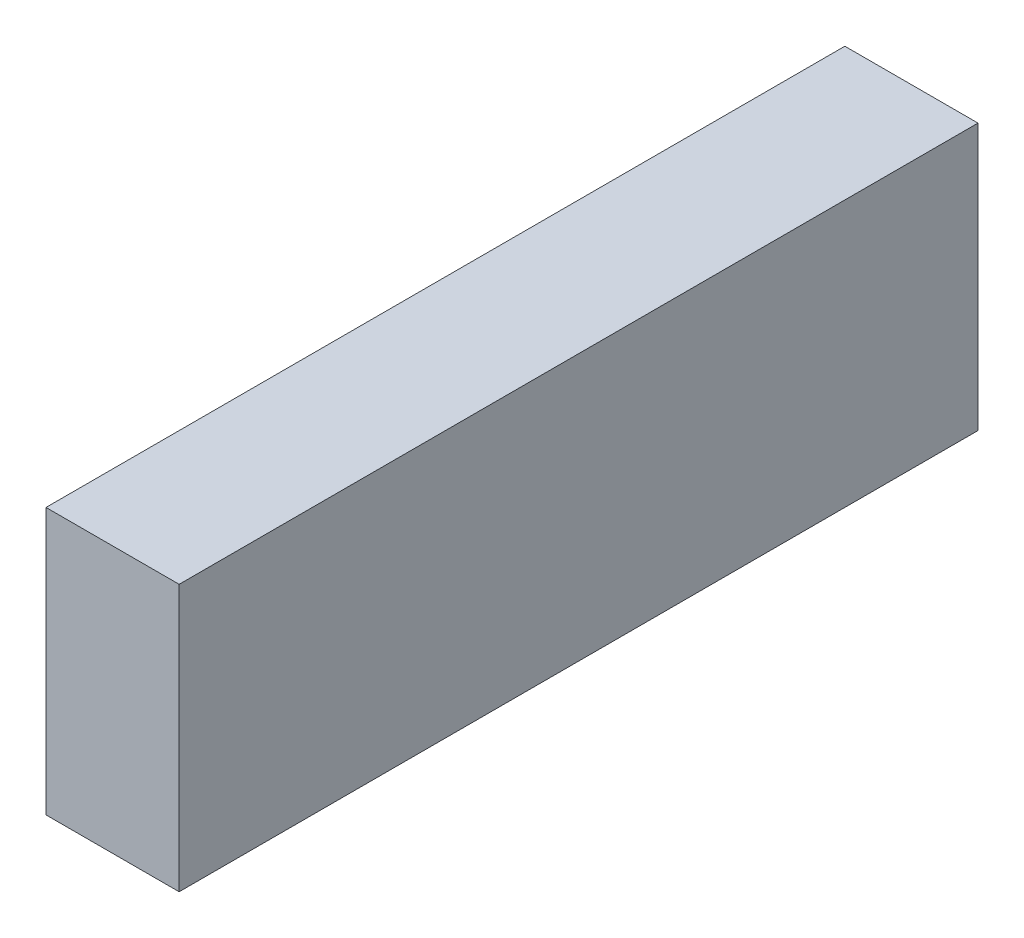
ISO-10303-21;
HEADER;
FILE_DESCRIPTION(('STEP AP214'),'2;1');
FILE_NAME('part.step','',(''),(''),'','','');
FILE_SCHEMA(('AUTOMOTIVE_DESIGN { 1 0 10303 214 1 1 1 1 }'));
ENDSEC;
DATA;
#1=APPLICATION_CONTEXT('core data for automotive mechanical design processes');
#2=APPLICATION_PROTOCOL_DEFINITION('international standard','automotive_design',2000,#1);
#3=PRODUCT_CONTEXT('',#1,'mechanical');
#4=PRODUCT('Part','Part','',(#3));
#5=PRODUCT_RELATED_PRODUCT_CATEGORY('part','',(#4));
#6=PRODUCT_DEFINITION_FORMATION('','',#4);
#7=PRODUCT_DEFINITION_CONTEXT('part definition',#1,'design');
#8=PRODUCT_DEFINITION('design','',#6,#7);
#9=PRODUCT_DEFINITION_SHAPE('','',#8);
#10=(LENGTH_UNIT() NAMED_UNIT(*) SI_UNIT(.MILLI.,.METRE.));
#11=(NAMED_UNIT(*) PLANE_ANGLE_UNIT() SI_UNIT($,.RADIAN.));
#12=(NAMED_UNIT(*) SI_UNIT($,.STERADIAN.) SOLID_ANGLE_UNIT());
#13=UNCERTAINTY_MEASURE_WITH_UNIT(LENGTH_MEASURE(1.E-05),#10,'distance_accuracy_value','');
#14=(GEOMETRIC_REPRESENTATION_CONTEXT(3) GLOBAL_UNCERTAINTY_ASSIGNED_CONTEXT((#13)) GLOBAL_UNIT_ASSIGNED_CONTEXT((#10,
#11,#12)) REPRESENTATION_CONTEXT('',''));
#15=CARTESIAN_POINT('',(0.,0.,0.));
#16=DIRECTION('',(0.,0.,1.));
#17=DIRECTION('',(1.,0.,0.));
#18=AXIS2_PLACEMENT_3D('',#15,#16,#17);
#19=CARTESIAN_POINT('',(25.,100.,150.));
#20=DIRECTION('',(-1.,0.,0.));
#21=DIRECTION('',(0.,0.,1.));
#22=AXIS2_PLACEMENT_3D('',#19,#20,#21);
#23=PLANE('',#22);
#24=DIRECTION('',(0.,0.,-1.));
#25=VECTOR('',#24,1.);
#26=CARTESIAN_POINT('',(25.,0.,150.));
#27=LINE('',#26,#25);
#28=CARTESIAN_POINT('',(25.,0.,150.));
#29=VERTEX_POINT('',#28);
#30=CARTESIAN_POINT('',(25.,0.,-150.));
#31=VERTEX_POINT('',#30);
#32=EDGE_CURVE('E96',#29,#31,#27,.T.);
#33=ORIENTED_EDGE('',*,*,#32,.T.);
#34=DIRECTION('',(0.,-1.,0.));
#35=VECTOR('',#34,1.);
#36=CARTESIAN_POINT('',(25.,100.,-150.));
#37=LINE('',#36,#35);
#38=CARTESIAN_POINT('',(25.,100.,-150.));
#39=VERTEX_POINT('',#38);
#40=EDGE_CURVE('E11',#39,#31,#37,.T.);
#41=ORIENTED_EDGE('',*,*,#40,.F.);
#42=DIRECTION('',(0.,0.,-1.));
#43=VECTOR('',#42,1.);
#44=CARTESIAN_POINT('',(25.,100.,150.));
#45=LINE('',#44,#43);
#46=CARTESIAN_POINT('',(25.,100.,150.));
#47=VERTEX_POINT('',#46);
#48=EDGE_CURVE('E84',#47,#39,#45,.T.);
#49=ORIENTED_EDGE('',*,*,#48,.F.);
#50=DIRECTION('',(0.,-1.,0.));
#51=VECTOR('',#50,1.);
#52=CARTESIAN_POINT('',(25.,100.,150.));
#53=LINE('',#52,#51);
#54=EDGE_CURVE('E92',#47,#29,#53,.T.);
#55=ORIENTED_EDGE('',*,*,#54,.T.);
#56=EDGE_LOOP('',(#33,#41,#49,#55));
#57=FACE_BOUND('',#56,.T.);
#58=ADVANCED_FACE('F33',(#57),#23,.F.);
#59=CARTESIAN_POINT('',(-25.,100.,-150.));
#60=DIRECTION('',(0.,0.,1.));
#61=DIRECTION('',(1.,0.,0.));
#62=AXIS2_PLACEMENT_3D('',#59,#60,#61);
#63=PLANE('',#62);
#64=DIRECTION('',(-1.,0.,0.));
#65=VECTOR('',#64,1.);
#66=CARTESIAN_POINT('',(-25.,0.,-150.));
#67=LINE('',#66,#65);
#68=CARTESIAN_POINT('',(-25.,0.,-150.));
#69=VERTEX_POINT('',#68);
#70=EDGE_CURVE('E88',#31,#69,#67,.T.);
#71=ORIENTED_EDGE('',*,*,#70,.T.);
#72=DIRECTION('',(0.,-1.,0.));
#73=VECTOR('',#72,1.);
#74=CARTESIAN_POINT('',(-25.,100.,-150.));
#75=LINE('',#74,#73);
#76=CARTESIAN_POINT('',(-25.,100.,-150.));
#77=VERTEX_POINT('',#76);
#78=EDGE_CURVE('E41',#77,#69,#75,.T.);
#79=ORIENTED_EDGE('',*,*,#78,.F.);
#80=DIRECTION('',(-1.,0.,0.));
#81=VECTOR('',#80,1.);
#82=CARTESIAN_POINT('',(-25.,100.,-150.));
#83=LINE('',#82,#81);
#84=EDGE_CURVE('E79',#39,#77,#83,.T.);
#85=ORIENTED_EDGE('',*,*,#84,.F.);
#86=ORIENTED_EDGE('',*,*,#40,.T.);
#87=EDGE_LOOP('',(#71,#79,#85,#86));
#88=FACE_BOUND('',#87,.T.);
#89=ADVANCED_FACE('F87',(#88),#63,.F.);
#90=CARTESIAN_POINT('',(-25.,100.,150.));
#91=DIRECTION('',(1.,0.,0.));
#92=DIRECTION('',(0.,0.,-1.));
#93=AXIS2_PLACEMENT_3D('',#90,#91,#92);
#94=PLANE('',#93);
#95=DIRECTION('',(0.,0.,1.));
#96=VECTOR('',#95,1.);
#97=CARTESIAN_POINT('',(-25.,0.,150.));
#98=LINE('',#97,#96);
#99=CARTESIAN_POINT('',(-25.,0.,150.));
#100=VERTEX_POINT('',#99);
#101=EDGE_CURVE('E66',#69,#100,#98,.T.);
#102=ORIENTED_EDGE('',*,*,#101,.T.);
#103=DIRECTION('',(0.,-1.,0.));
#104=VECTOR('',#103,1.);
#105=CARTESIAN_POINT('',(-25.,100.,150.));
#106=LINE('',#105,#104);
#107=CARTESIAN_POINT('',(-25.,100.,150.));
#108=VERTEX_POINT('',#107);
#109=EDGE_CURVE('E89',#108,#100,#106,.T.);
#110=ORIENTED_EDGE('',*,*,#109,.F.);
#111=DIRECTION('',(0.,0.,1.));
#112=VECTOR('',#111,1.);
#113=CARTESIAN_POINT('',(-25.,100.,150.));
#114=LINE('',#113,#112);
#115=EDGE_CURVE('E82',#77,#108,#114,.T.);
#116=ORIENTED_EDGE('',*,*,#115,.F.);
#117=ORIENTED_EDGE('',*,*,#78,.T.);
#118=EDGE_LOOP('',(#102,#110,#116,#117));
#119=FACE_BOUND('',#118,.T.);
#120=ADVANCED_FACE('F90',(#119),#94,.F.);
#121=CARTESIAN_POINT('',(-25.,100.,150.));
#122=DIRECTION('',(0.,0.,-1.));
#123=DIRECTION('',(-1.,0.,0.));
#124=AXIS2_PLACEMENT_3D('',#121,#122,#123);
#125=PLANE('',#124);
#126=DIRECTION('',(1.,0.,0.));
#127=VECTOR('',#126,1.);
#128=CARTESIAN_POINT('',(-25.,0.,150.));
#129=LINE('',#128,#127);
#130=EDGE_CURVE('E72',#100,#29,#129,.T.);
#131=ORIENTED_EDGE('',*,*,#130,.T.);
#132=ORIENTED_EDGE('',*,*,#54,.F.);
#133=DIRECTION('',(1.,0.,0.));
#134=VECTOR('',#133,1.);
#135=CARTESIAN_POINT('',(-25.,100.,150.));
#136=LINE('',#135,#134);
#137=EDGE_CURVE('E49',#108,#47,#136,.T.);
#138=ORIENTED_EDGE('',*,*,#137,.F.);
#139=ORIENTED_EDGE('',*,*,#109,.T.);
#140=EDGE_LOOP('',(#131,#132,#138,#139));
#141=FACE_BOUND('',#140,.T.);
#142=ADVANCED_FACE('F103',(#141),#125,.F.);
#143=CARTESIAN_POINT('',(0.,100.,0.));
#144=DIRECTION('',(0.,-1.,0.));
#145=DIRECTION('',(0.,0.,-1.));
#146=AXIS2_PLACEMENT_3D('',#143,#144,#145);
#147=PLANE('',#146);
#148=ORIENTED_EDGE('',*,*,#48,.T.);
#149=ORIENTED_EDGE('',*,*,#84,.T.);
#150=ORIENTED_EDGE('',*,*,#115,.T.);
#151=ORIENTED_EDGE('',*,*,#137,.T.);
#152=EDGE_LOOP('',(#148,#149,#150,#151));
#153=FACE_BOUND('',#152,.T.);
#154=ADVANCED_FACE('F80',(#153),#147,.F.);
#155=CARTESIAN_POINT('',(0.,0.,0.));
#156=DIRECTION('',(0.,-1.,0.));
#157=DIRECTION('',(0.,0.,-1.));
#158=AXIS2_PLACEMENT_3D('',#155,#156,#157);
#159=PLANE('',#158);
#160=ORIENTED_EDGE('',*,*,#32,.F.);
#161=ORIENTED_EDGE('',*,*,#130,.F.);
#162=ORIENTED_EDGE('',*,*,#101,.F.);
#163=ORIENTED_EDGE('',*,*,#70,.F.);
#164=EDGE_LOOP('',(#160,#161,#162,#163));
#165=FACE_BOUND('',#164,.T.);
#166=ADVANCED_FACE('F106',(#165),#159,.T.);
#167=CLOSED_SHELL('',(#58,#89,#120,#142,#154,#166));
#168=MANIFOLD_SOLID_BREP('B2',#167);
#169=ADVANCED_BREP_SHAPE_REPRESENTATION('',(#18,#168),#14);
#170=SHAPE_DEFINITION_REPRESENTATION(#9,#169);
ENDSEC;
END-ISO-10303-21;
